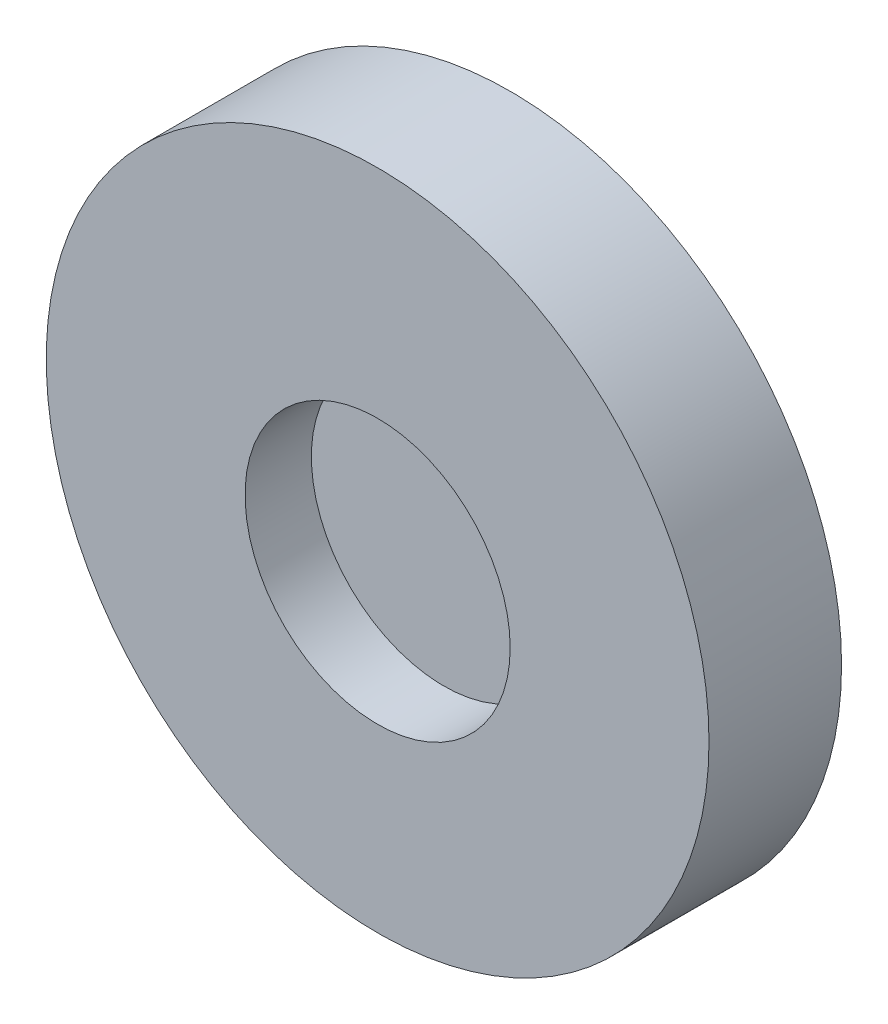
ISO-10303-21;
HEADER;
FILE_DESCRIPTION(('STEP AP214'),'2;1');
FILE_NAME('part.step','',(''),(''),'','','');
FILE_SCHEMA(('AUTOMOTIVE_DESIGN { 1 0 10303 214 1 1 1 1 }'));
ENDSEC;
DATA;
#1=APPLICATION_CONTEXT('core data for automotive mechanical design processes');
#2=APPLICATION_PROTOCOL_DEFINITION('international standard','automotive_design',2000,#1);
#3=PRODUCT_CONTEXT('',#1,'mechanical');
#4=PRODUCT('Part','Part','',(#3));
#5=PRODUCT_RELATED_PRODUCT_CATEGORY('part','',(#4));
#6=PRODUCT_DEFINITION_FORMATION('','',#4);
#7=PRODUCT_DEFINITION_CONTEXT('part definition',#1,'design');
#8=PRODUCT_DEFINITION('design','',#6,#7);
#9=PRODUCT_DEFINITION_SHAPE('','',#8);
#10=(LENGTH_UNIT() NAMED_UNIT(*) SI_UNIT(.MILLI.,.METRE.));
#11=(NAMED_UNIT(*) PLANE_ANGLE_UNIT() SI_UNIT($,.RADIAN.));
#12=(NAMED_UNIT(*) SI_UNIT($,.STERADIAN.) SOLID_ANGLE_UNIT());
#13=UNCERTAINTY_MEASURE_WITH_UNIT(LENGTH_MEASURE(1.E-05),#10,'distance_accuracy_value','');
#14=(GEOMETRIC_REPRESENTATION_CONTEXT(3) GLOBAL_UNCERTAINTY_ASSIGNED_CONTEXT((#13)) GLOBAL_UNIT_ASSIGNED_CONTEXT((#10,
#11,#12)) REPRESENTATION_CONTEXT('',''));
#15=CARTESIAN_POINT('',(0.,0.,0.));
#16=DIRECTION('',(0.,0.,1.));
#17=DIRECTION('',(1.,0.,0.));
#18=AXIS2_PLACEMENT_3D('',#15,#16,#17);
#19=CARTESIAN_POINT('',(0.,0.,25.4));
#20=DIRECTION('',(0.,0.,1.));
#21=DIRECTION('',(1.,0.,0.));
#22=AXIS2_PLACEMENT_3D('',#19,#20,#21);
#23=PLANE('',#22);
#24=CARTESIAN_POINT('',(0.,-6.96805144088829,25.4));
#25=DIRECTION('',(0.,0.,1.));
#26=DIRECTION('',(1.,0.,0.));
#27=AXIS2_PLACEMENT_3D('',#24,#25,#26);
#28=CIRCLE('',#27,50.8);
#29=CARTESIAN_POINT('',(50.8,-6.96805144088829,25.4));
#30=VERTEX_POINT('',#29);
#31=EDGE_CURVE('E18',#30,#30,#28,.T.);
#32=ORIENTED_EDGE('',*,*,#31,.T.);
#33=EDGE_LOOP('',(#32));
#34=FACE_BOUND('',#33,.T.);
#35=ADVANCED_FACE('F15',(#34),#23,.T.);
#36=CARTESIAN_POINT('',(0.,-6.96805144088829,50.8));
#37=DIRECTION('',(0.,0.,1.));
#38=DIRECTION('',(1.,0.,0.));
#39=AXIS2_PLACEMENT_3D('',#36,#37,#38);
#40=CYLINDRICAL_SURFACE('',#39,50.8);
#41=ORIENTED_EDGE('',*,*,#31,.F.);
#42=EDGE_LOOP('',(#41));
#43=FACE_BOUND('',#42,.T.);
#44=CARTESIAN_POINT('',(0.,-6.96805144088829,50.8));
#45=DIRECTION('',(0.,0.,1.));
#46=DIRECTION('',(1.,0.,0.));
#47=AXIS2_PLACEMENT_3D('',#44,#45,#46);
#48=CIRCLE('',#47,50.8);
#49=CARTESIAN_POINT('',(50.8,-6.96805144088829,50.8));
#50=VERTEX_POINT('',#49);
#51=EDGE_CURVE('E27',#50,#50,#48,.F.);
#52=ORIENTED_EDGE('',*,*,#51,.F.);
#53=EDGE_LOOP('',(#52));
#54=FACE_BOUND('',#53,.T.);
#55=ADVANCED_FACE('F36',(#43,#54),#40,.F.);
#56=CARTESIAN_POINT('',(0.,0.,50.8));
#57=DIRECTION('',(0.,0.,1.));
#58=DIRECTION('',(1.,0.,0.));
#59=AXIS2_PLACEMENT_3D('',#56,#57,#58);
#60=PLANE('',#59);
#61=ORIENTED_EDGE('',*,*,#51,.T.);
#62=EDGE_LOOP('',(#61));
#63=FACE_BOUND('',#62,.T.);
#64=CARTESIAN_POINT('',(0.,0.,50.8));
#65=DIRECTION('',(0.,0.,1.));
#66=DIRECTION('',(1.,0.,0.));
#67=AXIS2_PLACEMENT_3D('',#64,#65,#66);
#68=CIRCLE('',#67,127.);
#69=CARTESIAN_POINT('',(127.,0.,50.8));
#70=VERTEX_POINT('',#69);
#71=EDGE_CURVE('E22',#70,#70,#68,.F.);
#72=ORIENTED_EDGE('',*,*,#71,.F.);
#73=EDGE_LOOP('',(#72));
#74=FACE_BOUND('',#73,.T.);
#75=ADVANCED_FACE('F39',(#63,#74),#60,.T.);
#76=CARTESIAN_POINT('',(0.,0.,0.));
#77=DIRECTION('',(0.,0.,1.));
#78=DIRECTION('',(1.,0.,0.));
#79=AXIS2_PLACEMENT_3D('',#76,#77,#78);
#80=CYLINDRICAL_SURFACE('',#79,127.);
#81=ORIENTED_EDGE('',*,*,#71,.T.);
#82=EDGE_LOOP('',(#81));
#83=FACE_BOUND('',#82,.T.);
#84=CARTESIAN_POINT('',(0.,0.,0.));
#85=DIRECTION('',(0.,0.,1.));
#86=DIRECTION('',(1.,0.,0.));
#87=AXIS2_PLACEMENT_3D('',#84,#85,#86);
#88=CIRCLE('',#87,127.);
#89=CARTESIAN_POINT('',(127.,0.,0.));
#90=VERTEX_POINT('',#89);
#91=EDGE_CURVE('E10',#90,#90,#88,.T.);
#92=ORIENTED_EDGE('',*,*,#91,.T.);
#93=EDGE_LOOP('',(#92));
#94=FACE_BOUND('',#93,.T.);
#95=ADVANCED_FACE('F45',(#83,#94),#80,.T.);
#96=CARTESIAN_POINT('',(0.,0.,0.));
#97=DIRECTION('',(0.,0.,1.));
#98=DIRECTION('',(1.,0.,0.));
#99=AXIS2_PLACEMENT_3D('',#96,#97,#98);
#100=PLANE('',#99);
#101=ORIENTED_EDGE('',*,*,#91,.F.);
#102=EDGE_LOOP('',(#101));
#103=FACE_BOUND('',#102,.T.);
#104=ADVANCED_FACE('F47',(#103),#100,.F.);
#105=CLOSED_SHELL('',(#35,#55,#75,#95,#104));
#106=MANIFOLD_SOLID_BREP('B1',#105);
#107=ADVANCED_BREP_SHAPE_REPRESENTATION('',(#18,#106),#14);
#108=SHAPE_DEFINITION_REPRESENTATION(#9,#107);
ENDSEC;
END-ISO-10303-21;
